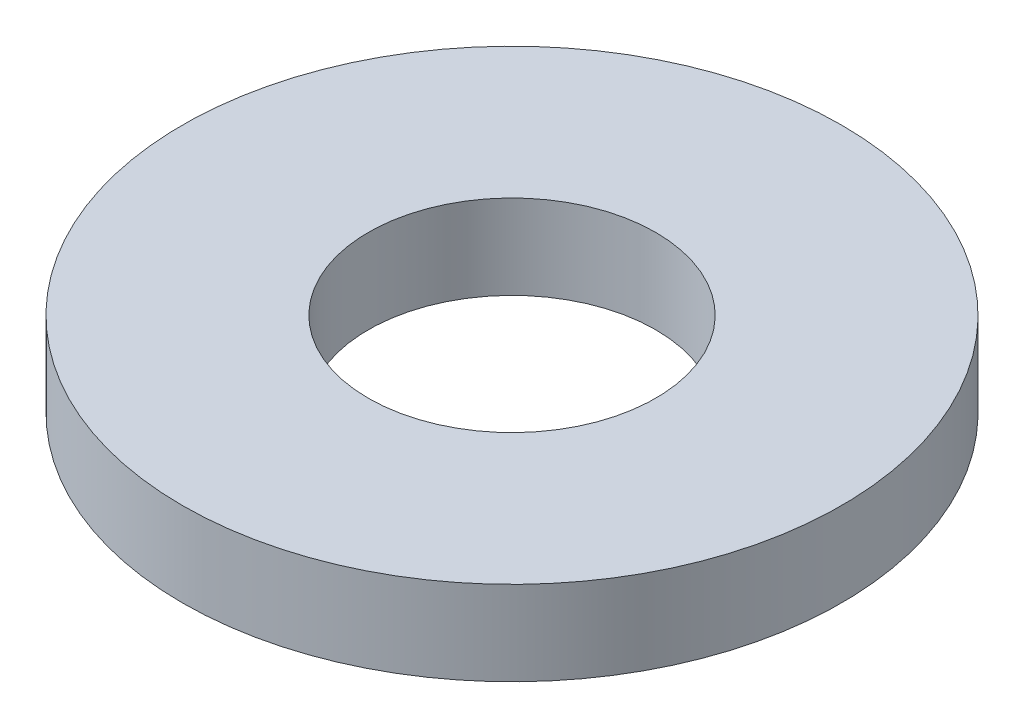
ISO-10303-21;
HEADER;
FILE_DESCRIPTION(('STEP AP214'),'2;1');
FILE_NAME('part.step','',(''),(''),'','','');
FILE_SCHEMA(('AUTOMOTIVE_DESIGN { 1 0 10303 214 1 1 1 1 }'));
ENDSEC;
DATA;
#1=APPLICATION_CONTEXT('core data for automotive mechanical design processes');
#2=APPLICATION_PROTOCOL_DEFINITION('international standard','automotive_design',2000,#1);
#3=PRODUCT_CONTEXT('',#1,'mechanical');
#4=PRODUCT('Part','Part','',(#3));
#5=PRODUCT_RELATED_PRODUCT_CATEGORY('part','',(#4));
#6=PRODUCT_DEFINITION_FORMATION('','',#4);
#7=PRODUCT_DEFINITION_CONTEXT('part definition',#1,'design');
#8=PRODUCT_DEFINITION('design','',#6,#7);
#9=PRODUCT_DEFINITION_SHAPE('','',#8);
#10=(LENGTH_UNIT() NAMED_UNIT(*) SI_UNIT(.MILLI.,.METRE.));
#11=(NAMED_UNIT(*) PLANE_ANGLE_UNIT() SI_UNIT($,.RADIAN.));
#12=(NAMED_UNIT(*) SI_UNIT($,.STERADIAN.) SOLID_ANGLE_UNIT());
#13=UNCERTAINTY_MEASURE_WITH_UNIT(LENGTH_MEASURE(1.E-05),#10,'distance_accuracy_value','');
#14=(GEOMETRIC_REPRESENTATION_CONTEXT(3) GLOBAL_UNCERTAINTY_ASSIGNED_CONTEXT((#13)) GLOBAL_UNIT_ASSIGNED_CONTEXT((#10,
#11,#12)) REPRESENTATION_CONTEXT('',''));
#15=CARTESIAN_POINT('',(0.,0.,0.));
#16=DIRECTION('',(0.,0.,1.));
#17=DIRECTION('',(1.,0.,0.));
#18=AXIS2_PLACEMENT_3D('',#15,#16,#17);
#19=CARTESIAN_POINT('',(0.,0.8128,0.));
#20=DIRECTION('',(0.,-1.,0.));
#21=DIRECTION('',(0.,0.,-1.));
#22=AXIS2_PLACEMENT_3D('',#19,#20,#21);
#23=CYLINDRICAL_SURFACE('',#22,3.175);
#24=CARTESIAN_POINT('',(0.,0.8128,0.));
#25=DIRECTION('',(0.,1.,0.));
#26=DIRECTION('',(0.,0.,1.));
#27=AXIS2_PLACEMENT_3D('',#24,#25,#26);
#28=CIRCLE('',#27,3.175);
#29=CARTESIAN_POINT('',(0.,0.8128,3.175));
#30=VERTEX_POINT('',#29);
#31=EDGE_CURVE('E10',#30,#30,#28,.T.);
#32=ORIENTED_EDGE('',*,*,#31,.F.);
#33=EDGE_LOOP('',(#32));
#34=FACE_BOUND('',#33,.T.);
#35=CARTESIAN_POINT('',(0.,0.,0.));
#36=DIRECTION('',(0.,1.,0.));
#37=DIRECTION('',(0.,0.,1.));
#38=AXIS2_PLACEMENT_3D('',#35,#36,#37);
#39=CIRCLE('',#38,3.175);
#40=CARTESIAN_POINT('',(0.,0.,3.175));
#41=VERTEX_POINT('',#40);
#42=EDGE_CURVE('E31',#41,#41,#39,.T.);
#43=ORIENTED_EDGE('',*,*,#42,.T.);
#44=EDGE_LOOP('',(#43));
#45=FACE_BOUND('',#44,.T.);
#46=ADVANCED_FACE('F28',(#34,#45),#23,.T.);
#47=CARTESIAN_POINT('',(0.,0.8128,0.));
#48=DIRECTION('',(0.,1.,0.));
#49=DIRECTION('',(0.,0.,1.));
#50=AXIS2_PLACEMENT_3D('',#47,#48,#49);
#51=PLANE('',#50);
#52=CARTESIAN_POINT('',(0.,0.8128,0.));
#53=DIRECTION('',(0.,1.,0.));
#54=DIRECTION('',(0.,0.,1.));
#55=AXIS2_PLACEMENT_3D('',#52,#53,#54);
#56=CIRCLE('',#55,1.3843);
#57=CARTESIAN_POINT('',(0.,0.8128,1.3843));
#58=VERTEX_POINT('',#57);
#59=EDGE_CURVE('E40',#58,#58,#56,.T.);
#60=ORIENTED_EDGE('',*,*,#59,.F.);
#61=EDGE_LOOP('',(#60));
#62=FACE_BOUND('',#61,.T.);
#63=ORIENTED_EDGE('',*,*,#31,.T.);
#64=EDGE_LOOP('',(#63));
#65=FACE_BOUND('',#64,.T.);
#66=ADVANCED_FACE('F55',(#62,#65),#51,.T.);
#67=CARTESIAN_POINT('',(0.,0.,0.));
#68=DIRECTION('',(0.,1.,0.));
#69=DIRECTION('',(0.,0.,1.));
#70=AXIS2_PLACEMENT_3D('',#67,#68,#69);
#71=PLANE('',#70);
#72=CARTESIAN_POINT('',(0.,0.,0.));
#73=DIRECTION('',(0.,1.,0.));
#74=DIRECTION('',(0.,0.,1.));
#75=AXIS2_PLACEMENT_3D('',#72,#73,#74);
#76=CIRCLE('',#75,1.3843);
#77=CARTESIAN_POINT('',(0.,0.,1.3843));
#78=VERTEX_POINT('',#77);
#79=EDGE_CURVE('E38',#78,#78,#76,.T.);
#80=ORIENTED_EDGE('',*,*,#79,.T.);
#81=EDGE_LOOP('',(#80));
#82=FACE_BOUND('',#81,.T.);
#83=ORIENTED_EDGE('',*,*,#42,.F.);
#84=EDGE_LOOP('',(#83));
#85=FACE_BOUND('',#84,.T.);
#86=ADVANCED_FACE('F46',(#82,#85),#71,.F.);
#87=CARTESIAN_POINT('',(0.,0.,0.));
#88=DIRECTION('',(0.,1.,0.));
#89=DIRECTION('',(0.,0.,1.));
#90=AXIS2_PLACEMENT_3D('',#87,#88,#89);
#91=CYLINDRICAL_SURFACE('',#90,1.3843);
#92=ORIENTED_EDGE('',*,*,#79,.F.);
#93=EDGE_LOOP('',(#92));
#94=FACE_BOUND('',#93,.T.);
#95=ORIENTED_EDGE('',*,*,#59,.T.);
#96=EDGE_LOOP('',(#95));
#97=FACE_BOUND('',#96,.T.);
#98=ADVANCED_FACE('F49',(#94,#97),#91,.F.);
#99=CLOSED_SHELL('',(#46,#66,#86,#98));
#100=MANIFOLD_SOLID_BREP('B2',#99);
#101=ADVANCED_BREP_SHAPE_REPRESENTATION('',(#18,#100),#14);
#102=SHAPE_DEFINITION_REPRESENTATION(#9,#101);
ENDSEC;
END-ISO-10303-21;
